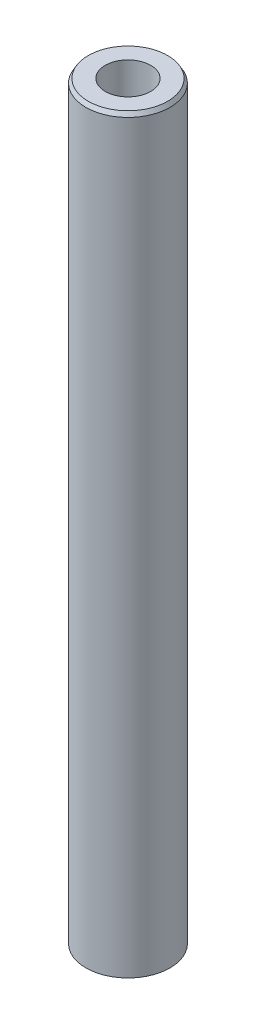
ISO-10303-21;
HEADER;
FILE_DESCRIPTION(('STEP AP214'),'2;1');
FILE_NAME('part.step','',(''),(''),'','','');
FILE_SCHEMA(('AUTOMOTIVE_DESIGN { 1 0 10303 214 1 1 1 1 }'));
ENDSEC;
DATA;
#1=APPLICATION_CONTEXT('core data for automotive mechanical design processes');
#2=APPLICATION_PROTOCOL_DEFINITION('international standard','automotive_design',2000,#1);
#3=PRODUCT_CONTEXT('',#1,'mechanical');
#4=PRODUCT('Part','Part','',(#3));
#5=PRODUCT_RELATED_PRODUCT_CATEGORY('part','',(#4));
#6=PRODUCT_DEFINITION_FORMATION('','',#4);
#7=PRODUCT_DEFINITION_CONTEXT('part definition',#1,'design');
#8=PRODUCT_DEFINITION('design','',#6,#7);
#9=PRODUCT_DEFINITION_SHAPE('','',#8);
#10=(LENGTH_UNIT() NAMED_UNIT(*) SI_UNIT(.MILLI.,.METRE.));
#11=(NAMED_UNIT(*) PLANE_ANGLE_UNIT() SI_UNIT($,.RADIAN.));
#12=(NAMED_UNIT(*) SI_UNIT($,.STERADIAN.) SOLID_ANGLE_UNIT());
#13=UNCERTAINTY_MEASURE_WITH_UNIT(LENGTH_MEASURE(1.E-05),#10,'distance_accuracy_value','');
#14=(GEOMETRIC_REPRESENTATION_CONTEXT(3) GLOBAL_UNCERTAINTY_ASSIGNED_CONTEXT((#13)) GLOBAL_UNIT_ASSIGNED_CONTEXT((#10,
#11,#12)) REPRESENTATION_CONTEXT('',''));
#15=CARTESIAN_POINT('',(0.,0.,0.));
#16=DIRECTION('',(0.,0.,1.));
#17=DIRECTION('',(1.,0.,0.));
#18=AXIS2_PLACEMENT_3D('',#15,#16,#17);
#19=CARTESIAN_POINT('',(0.,357.599281503434,0.));
#20=DIRECTION('',(0.,-1.,0.));
#21=DIRECTION('',(0.,0.,-1.));
#22=AXIS2_PLACEMENT_3D('',#19,#20,#21);
#23=CYLINDRICAL_SURFACE('',#22,20.);
#24=CARTESIAN_POINT('',(0.,355.643603092328,0.));
#25=DIRECTION('',(0.,1.,0.));
#26=DIRECTION('',(0.,0.,1.));
#27=AXIS2_PLACEMENT_3D('',#24,#25,#26);
#28=CIRCLE('',#27,20.);
#29=CARTESIAN_POINT('',(0.,355.643603092328,20.));
#30=VERTEX_POINT('',#29);
#31=EDGE_CURVE('E50',#30,#30,#28,.F.);
#32=ORIENTED_EDGE('',*,*,#31,.T.);
#33=EDGE_LOOP('',(#32));
#34=FACE_BOUND('',#33,.T.);
#35=CARTESIAN_POINT('',(0.,1.12911145710021,0.));
#36=DIRECTION('',(0.,1.,0.));
#37=DIRECTION('',(0.,0.,1.));
#38=AXIS2_PLACEMENT_3D('',#35,#36,#37);
#39=CIRCLE('',#38,20.);
#40=CARTESIAN_POINT('',(0.,1.12911145710021,20.));
#41=VERTEX_POINT('',#40);
#42=EDGE_CURVE('E51',#41,#41,#39,.T.);
#43=ORIENTED_EDGE('',*,*,#42,.T.);
#44=EDGE_LOOP('',(#43));
#45=FACE_BOUND('',#44,.T.);
#46=ADVANCED_FACE('F39',(#34,#45),#23,.T.);
#47=CARTESIAN_POINT('',(0.,357.599281503434,0.));
#48=DIRECTION('',(0.,1.,0.));
#49=DIRECTION('',(0.,0.,1.));
#50=AXIS2_PLACEMENT_3D('',#47,#48,#49);
#51=PLANE('',#50);
#52=CARTESIAN_POINT('',(0.,357.599281503434,0.));
#53=DIRECTION('',(0.,1.,0.));
#54=DIRECTION('',(0.,0.,1.));
#55=AXIS2_PLACEMENT_3D('',#52,#53,#54);
#56=CIRCLE('',#55,18.8708885428998);
#57=CARTESIAN_POINT('',(0.,357.599281503434,18.8708885428998));
#58=VERTEX_POINT('',#57);
#59=EDGE_CURVE('E54',#58,#58,#56,.T.);
#60=ORIENTED_EDGE('',*,*,#59,.T.);
#61=EDGE_LOOP('',(#60));
#62=FACE_BOUND('',#61,.T.);
#63=CARTESIAN_POINT('',(0.,357.599281503434,0.));
#64=DIRECTION('',(0.,1.,0.));
#65=DIRECTION('',(0.,0.,1.));
#66=AXIS2_PLACEMENT_3D('',#63,#64,#65);
#67=CIRCLE('',#66,10.8051556445212);
#68=CARTESIAN_POINT('',(0.,357.599281503434,10.8051556445212));
#69=VERTEX_POINT('',#68);
#70=EDGE_CURVE('E58',#69,#69,#67,.T.);
#71=ORIENTED_EDGE('',*,*,#70,.F.);
#72=EDGE_LOOP('',(#71));
#73=FACE_BOUND('',#72,.T.);
#74=ADVANCED_FACE('F69',(#62,#73),#51,.T.);
#75=CARTESIAN_POINT('',(0.,0.,0.));
#76=DIRECTION('',(0.,1.,0.));
#77=DIRECTION('',(0.,0.,1.));
#78=AXIS2_PLACEMENT_3D('',#75,#76,#77);
#79=PLANE('',#78);
#80=CARTESIAN_POINT('',(0.,0.,0.));
#81=DIRECTION('',(0.,1.,0.));
#82=DIRECTION('',(0.,0.,1.));
#83=AXIS2_PLACEMENT_3D('',#80,#81,#82);
#84=CIRCLE('',#83,18.0443215888943);
#85=CARTESIAN_POINT('',(0.,0.,18.0443215888943));
#86=VERTEX_POINT('',#85);
#87=EDGE_CURVE('E10',#86,#86,#84,.F.);
#88=ORIENTED_EDGE('',*,*,#87,.T.);
#89=EDGE_LOOP('',(#88));
#90=FACE_BOUND('',#89,.T.);
#91=CARTESIAN_POINT('',(0.,0.,0.));
#92=DIRECTION('',(0.,1.,0.));
#93=DIRECTION('',(0.,0.,1.));
#94=AXIS2_PLACEMENT_3D('',#91,#92,#93);
#95=CIRCLE('',#94,10.8051556445212);
#96=CARTESIAN_POINT('',(0.,0.,10.8051556445212));
#97=VERTEX_POINT('',#96);
#98=EDGE_CURVE('E63',#97,#97,#95,.T.);
#99=ORIENTED_EDGE('',*,*,#98,.T.);
#100=EDGE_LOOP('',(#99));
#101=FACE_BOUND('',#100,.T.);
#102=ADVANCED_FACE('F75',(#90,#101),#79,.F.);
#103=CARTESIAN_POINT('',(0.,357.599281503434,0.));
#104=DIRECTION('',(0.,-1.,0.));
#105=DIRECTION('',(0.,0.,-1.));
#106=AXIS2_PLACEMENT_3D('',#103,#104,#105);
#107=CYLINDRICAL_SURFACE('',#106,10.8051556445212);
#108=ORIENTED_EDGE('',*,*,#70,.T.);
#109=EDGE_LOOP('',(#108));
#110=FACE_BOUND('',#109,.T.);
#111=ORIENTED_EDGE('',*,*,#98,.F.);
#112=EDGE_LOOP('',(#111));
#113=FACE_BOUND('',#112,.T.);
#114=ADVANCED_FACE('F70',(#110,#113),#107,.F.);
#115=CARTESIAN_POINT('',(0.,357.599281503434,0.));
#116=DIRECTION('',(0.,-1.,0.));
#117=DIRECTION('',(0.,0.,-1.));
#118=AXIS2_PLACEMENT_3D('',#115,#116,#117);
#119=CONICAL_SURFACE('',#118,18.8708885428998,0.523598775598293);
#120=ORIENTED_EDGE('',*,*,#31,.F.);
#121=EDGE_LOOP('',(#120));
#122=FACE_BOUND('',#121,.T.);
#123=ORIENTED_EDGE('',*,*,#59,.F.);
#124=EDGE_LOOP('',(#123));
#125=FACE_BOUND('',#124,.T.);
#126=ADVANCED_FACE('F81',(#122,#125),#119,.T.);
#127=CARTESIAN_POINT('',(0.,1.12911145710021,0.));
#128=DIRECTION('',(0.,1.,0.));
#129=DIRECTION('',(0.,0.,1.));
#130=AXIS2_PLACEMENT_3D('',#127,#128,#129);
#131=CONICAL_SURFACE('',#130,20.,1.0471975511966);
#132=ORIENTED_EDGE('',*,*,#87,.F.);
#133=EDGE_LOOP('',(#132));
#134=FACE_BOUND('',#133,.T.);
#135=ORIENTED_EDGE('',*,*,#42,.F.);
#136=EDGE_LOOP('',(#135));
#137=FACE_BOUND('',#136,.T.);
#138=ADVANCED_FACE('F45',(#134,#137),#131,.T.);
#139=CLOSED_SHELL('',(#46,#74,#102,#114,#126,#138));
#140=MANIFOLD_SOLID_BREP('B2',#139);
#141=ADVANCED_BREP_SHAPE_REPRESENTATION('',(#18,#140),#14);
#142=SHAPE_DEFINITION_REPRESENTATION(#9,#141);
ENDSEC;
END-ISO-10303-21;
